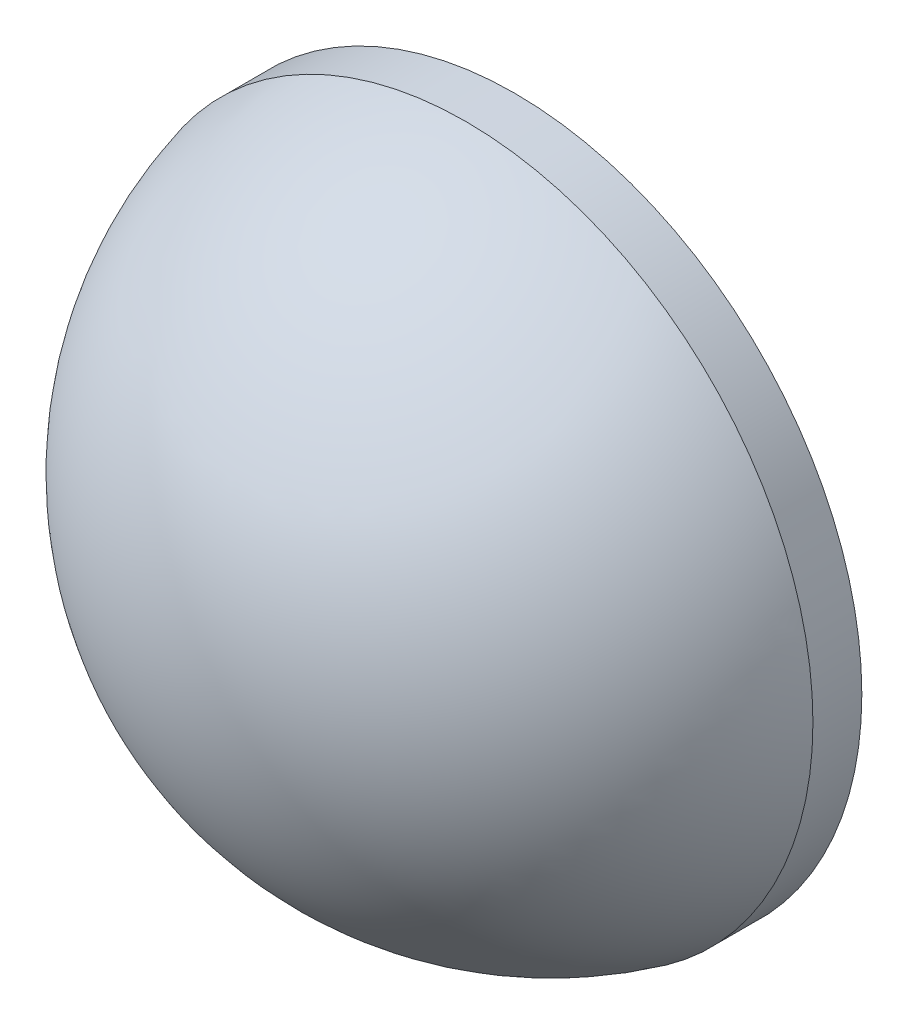
ISO-10303-21;
HEADER;
FILE_DESCRIPTION(('STEP AP214'),'2;1');
FILE_NAME('part.step','',(''),(''),'','','');
FILE_SCHEMA(('AUTOMOTIVE_DESIGN { 1 0 10303 214 1 1 1 1 }'));
ENDSEC;
DATA;
#1=APPLICATION_CONTEXT('core data for automotive mechanical design processes');
#2=APPLICATION_PROTOCOL_DEFINITION('international standard','automotive_design',2000,#1);
#3=PRODUCT_CONTEXT('',#1,'mechanical');
#4=PRODUCT('Part','Part','',(#3));
#5=PRODUCT_RELATED_PRODUCT_CATEGORY('part','',(#4));
#6=PRODUCT_DEFINITION_FORMATION('','',#4);
#7=PRODUCT_DEFINITION_CONTEXT('part definition',#1,'design');
#8=PRODUCT_DEFINITION('design','',#6,#7);
#9=PRODUCT_DEFINITION_SHAPE('','',#8);
#10=(LENGTH_UNIT() NAMED_UNIT(*) SI_UNIT(.MILLI.,.METRE.));
#11=(NAMED_UNIT(*) PLANE_ANGLE_UNIT() SI_UNIT($,.RADIAN.));
#12=(NAMED_UNIT(*) SI_UNIT($,.STERADIAN.) SOLID_ANGLE_UNIT());
#13=UNCERTAINTY_MEASURE_WITH_UNIT(LENGTH_MEASURE(1.E-05),#10,'distance_accuracy_value','');
#14=(GEOMETRIC_REPRESENTATION_CONTEXT(3) GLOBAL_UNCERTAINTY_ASSIGNED_CONTEXT((#13)) GLOBAL_UNIT_ASSIGNED_CONTEXT((#10,
#11,#12)) REPRESENTATION_CONTEXT('',''));
#15=CARTESIAN_POINT('',(0.,0.,0.));
#16=DIRECTION('',(0.,0.,1.));
#17=DIRECTION('',(1.,0.,0.));
#18=AXIS2_PLACEMENT_3D('',#15,#16,#17);
#19=CARTESIAN_POINT('',(0.,0.,-7.21));
#20=DIRECTION('',(0.,0.,1.));
#21=DIRECTION('',(0.,1.,0.));
#22=AXIS2_PLACEMENT_3D('',#19,#20,#21);
#23=SPHERICAL_SURFACE('',#22,13.08);
#24=CARTESIAN_POINT('',(0.,0.,-4.0800798732236));
#25=DIRECTION('',(0.,0.,1.));
#26=DIRECTION('',(1.,0.,0.));
#27=AXIS2_PLACEMENT_3D('',#24,#25,#26);
#28=CIRCLE('',#27,12.7);
#29=CARTESIAN_POINT('',(12.7,0.,-4.0800798732236));
#30=VERTEX_POINT('',#29);
#31=EDGE_CURVE('E8',#30,#30,#28,.T.);
#32=ORIENTED_EDGE('',*,*,#31,.T.);
#33=EDGE_LOOP('',(#32));
#34=FACE_BOUND('',#33,.T.);
#35=ADVANCED_FACE('F12',(#34),#23,.T.);
#36=CARTESIAN_POINT('',(0.,0.,4.30813204540037));
#37=DIRECTION('',(0.,0.,1.));
#38=DIRECTION('',(1.,0.,0.));
#39=AXIS2_PLACEMENT_3D('',#36,#37,#38);
#40=CYLINDRICAL_SURFACE('',#39,12.7);
#41=ORIENTED_EDGE('',*,*,#31,.F.);
#42=EDGE_LOOP('',(#41));
#43=FACE_BOUND('',#42,.T.);
#44=CARTESIAN_POINT('',(0.,0.,-5.87));
#45=DIRECTION('',(0.,0.,1.));
#46=DIRECTION('',(1.,0.,0.));
#47=AXIS2_PLACEMENT_3D('',#44,#45,#46);
#48=CIRCLE('',#47,12.7);
#49=CARTESIAN_POINT('',(12.7,0.,-5.87));
#50=VERTEX_POINT('',#49);
#51=EDGE_CURVE('E18',#50,#50,#48,.T.);
#52=ORIENTED_EDGE('',*,*,#51,.T.);
#53=EDGE_LOOP('',(#52));
#54=FACE_BOUND('',#53,.T.);
#55=ADVANCED_FACE('F24',(#43,#54),#40,.T.);
#56=CARTESIAN_POINT('',(0.,0.,-5.87));
#57=DIRECTION('',(0.,0.,1.));
#58=DIRECTION('',(1.,0.,0.));
#59=AXIS2_PLACEMENT_3D('',#56,#57,#58);
#60=PLANE('',#59);
#61=ORIENTED_EDGE('',*,*,#51,.F.);
#62=EDGE_LOOP('',(#61));
#63=FACE_BOUND('',#62,.T.);
#64=ADVANCED_FACE('F26',(#63),#60,.F.);
#65=CLOSED_SHELL('',(#35,#55,#64));
#66=MANIFOLD_SOLID_BREP('B1',#65);
#67=ADVANCED_BREP_SHAPE_REPRESENTATION('',(#18,#66),#14);
#68=SHAPE_DEFINITION_REPRESENTATION(#9,#67);
ENDSEC;
END-ISO-10303-21;
